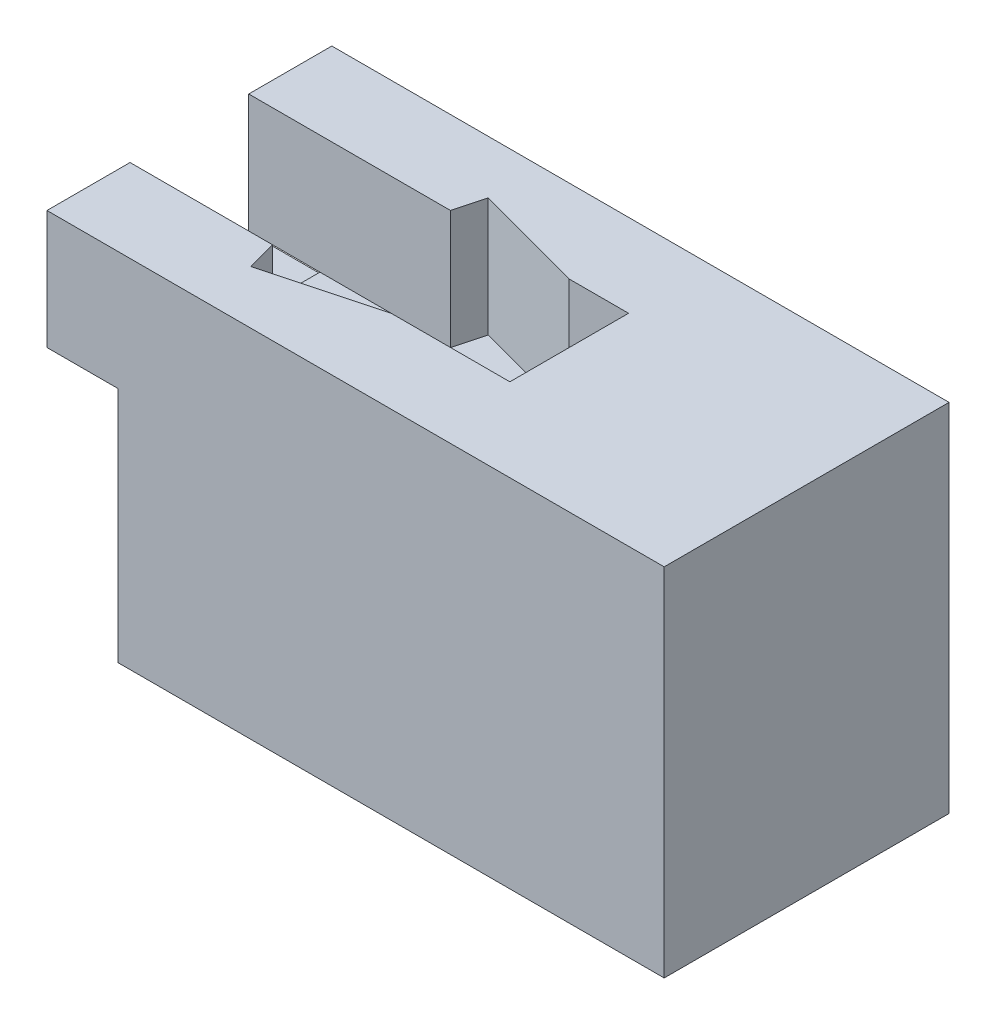
ISO-10303-21;
HEADER;
FILE_DESCRIPTION(('STEP AP214'),'2;1');
FILE_NAME('part.step','',(''),(''),'','','');
FILE_SCHEMA(('AUTOMOTIVE_DESIGN { 1 0 10303 214 1 1 1 1 }'));
ENDSEC;
DATA;
#1=APPLICATION_CONTEXT('core data for automotive mechanical design processes');
#2=APPLICATION_PROTOCOL_DEFINITION('international standard','automotive_design',2000,#1);
#3=PRODUCT_CONTEXT('',#1,'mechanical');
#4=PRODUCT('Part','Part','',(#3));
#5=PRODUCT_RELATED_PRODUCT_CATEGORY('part','',(#4));
#6=PRODUCT_DEFINITION_FORMATION('','',#4);
#7=PRODUCT_DEFINITION_CONTEXT('part definition',#1,'design');
#8=PRODUCT_DEFINITION('design','',#6,#7);
#9=PRODUCT_DEFINITION_SHAPE('','',#8);
#10=(LENGTH_UNIT() NAMED_UNIT(*) SI_UNIT(.MILLI.,.METRE.));
#11=(NAMED_UNIT(*) PLANE_ANGLE_UNIT() SI_UNIT($,.RADIAN.));
#12=(NAMED_UNIT(*) SI_UNIT($,.STERADIAN.) SOLID_ANGLE_UNIT());
#13=UNCERTAINTY_MEASURE_WITH_UNIT(LENGTH_MEASURE(1.E-05),#10,'distance_accuracy_value','');
#14=(GEOMETRIC_REPRESENTATION_CONTEXT(3) GLOBAL_UNCERTAINTY_ASSIGNED_CONTEXT((#13)) GLOBAL_UNIT_ASSIGNED_CONTEXT((#10,
#11,#12)) REPRESENTATION_CONTEXT('',''));
#15=CARTESIAN_POINT('',(0.,0.,0.));
#16=DIRECTION('',(0.,0.,1.));
#17=DIRECTION('',(1.,0.,0.));
#18=AXIS2_PLACEMENT_3D('',#15,#16,#17);
#19=CARTESIAN_POINT('',(-30.,0.,0.));
#20=DIRECTION('',(1.,0.,0.));
#21=DIRECTION('',(0.,0.,-1.));
#22=AXIS2_PLACEMENT_3D('',#19,#20,#21);
#23=PLANE('',#22);
#24=DIRECTION('',(0.,-1.,0.));
#25=VECTOR('',#24,1.);
#26=CARTESIAN_POINT('',(-30.,0.,-85.));
#27=LINE('',#26,#25);
#28=CARTESIAN_POINT('',(-30.,99.5,-85.));
#29=VERTEX_POINT('',#28);
#30=CARTESIAN_POINT('',(-30.,0.,-85.));
#31=VERTEX_POINT('',#30);
#32=EDGE_CURVE('E51',#29,#31,#27,.T.);
#33=ORIENTED_EDGE('',*,*,#32,.F.);
#34=DIRECTION('',(0.,0.,1.));
#35=VECTOR('',#34,1.);
#36=CARTESIAN_POINT('',(-30.,99.5,0.));
#37=LINE('',#36,#35);
#38=CARTESIAN_POINT('',(-30.,99.5,-35.));
#39=VERTEX_POINT('',#38);
#40=EDGE_CURVE('E56',#29,#39,#37,.T.);
#41=ORIENTED_EDGE('',*,*,#40,.T.);
#42=DIRECTION('',(0.,-1.,0.));
#43=VECTOR('',#42,1.);
#44=CARTESIAN_POINT('',(-30.,0.,-35.));
#45=LINE('',#44,#43);
#46=CARTESIAN_POINT('',(-30.,0.,-35.));
#47=VERTEX_POINT('',#46);
#48=EDGE_CURVE('E199',#39,#47,#45,.T.);
#49=ORIENTED_EDGE('',*,*,#48,.T.);
#50=DIRECTION('',(0.,0.,1.));
#51=VECTOR('',#50,1.);
#52=CARTESIAN_POINT('',(-30.,0.,-120.));
#53=LINE('',#52,#51);
#54=CARTESIAN_POINT('',(-30.,0.,0.));
#55=VERTEX_POINT('',#54);
#56=EDGE_CURVE('E256',#47,#55,#53,.T.);
#57=ORIENTED_EDGE('',*,*,#56,.T.);
#58=DIRECTION('',(0.,1.,0.));
#59=VECTOR('',#58,1.);
#60=CARTESIAN_POINT('',(-30.,0.,0.));
#61=LINE('',#60,#59);
#62=CARTESIAN_POINT('',(-30.,100.,0.));
#63=VERTEX_POINT('',#62);
#64=EDGE_CURVE('E259',#55,#63,#61,.T.);
#65=ORIENTED_EDGE('',*,*,#64,.T.);
#66=DIRECTION('',(0.,0.,1.));
#67=VECTOR('',#66,1.);
#68=CARTESIAN_POINT('',(-30.,100.,0.));
#69=LINE('',#68,#67);
#70=CARTESIAN_POINT('',(-30.,100.,-35.));
#71=VERTEX_POINT('',#70);
#72=EDGE_CURVE('E185',#71,#63,#69,.T.);
#73=ORIENTED_EDGE('',*,*,#72,.F.);
#74=DIRECTION('',(0.,0.,-1.));
#75=VECTOR('',#74,1.);
#76=CARTESIAN_POINT('',(-30.,100.,-35.));
#77=LINE('',#76,#75);
#78=CARTESIAN_POINT('',(-30.,100.,-85.));
#79=VERTEX_POINT('',#78);
#80=EDGE_CURVE('E252',#71,#79,#77,.T.);
#81=ORIENTED_EDGE('',*,*,#80,.T.);
#82=DIRECTION('',(0.,0.,1.));
#83=VECTOR('',#82,1.);
#84=CARTESIAN_POINT('',(-30.,100.,0.));
#85=LINE('',#84,#83);
#86=CARTESIAN_POINT('',(-30.,100.,-120.));
#87=VERTEX_POINT('',#86);
#88=EDGE_CURVE('E232',#87,#79,#85,.T.);
#89=ORIENTED_EDGE('',*,*,#88,.F.);
#90=DIRECTION('',(0.,-1.,0.));
#91=VECTOR('',#90,1.);
#92=CARTESIAN_POINT('',(-30.,150.,-120.));
#93=LINE('',#92,#91);
#94=CARTESIAN_POINT('',(-30.,0.,-120.));
#95=VERTEX_POINT('',#94);
#96=EDGE_CURVE('E254',#87,#95,#93,.T.);
#97=ORIENTED_EDGE('',*,*,#96,.T.);
#98=EDGE_CURVE('E257',#95,#31,#53,.T.);
#99=ORIENTED_EDGE('',*,*,#98,.T.);
#100=EDGE_LOOP('',(#33,#41,#49,#57,#65,#73,#81,#89,#97,#99));
#101=FACE_BOUND('',#100,.T.);
#102=ADVANCED_FACE('F36',(#101),#23,.F.);
#103=CARTESIAN_POINT('',(200.,150.,0.));
#104=DIRECTION('',(0.,-1.,0.));
#105=DIRECTION('',(0.,0.,-1.));
#106=AXIS2_PLACEMENT_3D('',#103,#104,#105);
#107=PLANE('',#106);
#108=DIRECTION('',(1.,0.,0.));
#109=VECTOR('',#108,1.);
#110=CARTESIAN_POINT('',(0.,150.,-85.));
#111=LINE('',#110,#109);
#112=CARTESIAN_POINT('',(-60.,150.,-85.));
#113=VERTEX_POINT('',#112);
#114=CARTESIAN_POINT('',(25.,150.,-85.));
#115=VERTEX_POINT('',#114);
#116=EDGE_CURVE('E270',#113,#115,#111,.T.);
#117=ORIENTED_EDGE('',*,*,#116,.T.);
#118=DIRECTION('',(-0.258819045102525,0.,0.965925826289067));
#119=VECTOR('',#118,1.);
#120=CARTESIAN_POINT('',(2.07531754730515,150.,0.556079660838562));
#121=LINE('',#120,#119);
#122=CARTESIAN_POINT('',(28.349364905389,150.,-97.4999999999997));
#123=VERTEX_POINT('',#122);
#124=EDGE_CURVE('E304',#123,#115,#121,.T.);
#125=ORIENTED_EDGE('',*,*,#124,.F.);
#126=DIRECTION('',(-0.96592582628907,0.,-0.258819045102514));
#127=VECTOR('',#126,1.);
#128=CARTESIAN_POINT('',(26.2740473580828,150.,-98.0560796608385));
#129=LINE('',#128,#127);
#130=CARTESIAN_POINT('',(75.,150.,-85.));
#131=VERTEX_POINT('',#130);
#132=EDGE_CURVE('E301',#131,#123,#129,.T.);
#133=ORIENTED_EDGE('',*,*,#132,.F.);
#134=CARTESIAN_POINT('',(100.,150.,-85.));
#135=VERTEX_POINT('',#134);
#136=EDGE_CURVE('E298',#131,#135,#111,.T.);
#137=ORIENTED_EDGE('',*,*,#136,.T.);
#138=DIRECTION('',(0.,0.,1.));
#139=VECTOR('',#138,1.);
#140=CARTESIAN_POINT('',(100.,150.,0.));
#141=LINE('',#140,#139);
#142=CARTESIAN_POINT('',(100.,150.,-35.));
#143=VERTEX_POINT('',#142);
#144=EDGE_CURVE('E295',#135,#143,#141,.T.);
#145=ORIENTED_EDGE('',*,*,#144,.T.);
#146=DIRECTION('',(1.,0.,0.));
#147=VECTOR('',#146,1.);
#148=CARTESIAN_POINT('',(0.,150.,-35.));
#149=LINE('',#148,#147);
#150=CARTESIAN_POINT('',(50.,150.,-35.));
#151=VERTEX_POINT('',#150);
#152=EDGE_CURVE('E292',#151,#143,#149,.T.);
#153=ORIENTED_EDGE('',*,*,#152,.F.);
#154=DIRECTION('',(0.96592582628907,0.,-0.258819045102514));
#155=VECTOR('',#154,1.);
#156=CARTESIAN_POINT('',(-5.40063509461093,150.,-20.1554445662281));
#157=LINE('',#156,#155);
#158=CARTESIAN_POINT('',(3.34936490538902,150.,-22.5000000000003));
#159=VERTEX_POINT('',#158);
#160=EDGE_CURVE('E289',#159,#151,#157,.T.);
#161=ORIENTED_EDGE('',*,*,#160,.F.);
#162=DIRECTION('',(0.258819045102525,0.,0.965925826289067));
#163=VECTOR('',#162,1.);
#164=CARTESIAN_POINT('',(8.75000000000014,150.,-2.3445554337724));
#165=LINE('',#164,#163);
#166=CARTESIAN_POINT('',(0.,150.,-35.));
#167=VERTEX_POINT('',#166);
#168=EDGE_CURVE('E265',#167,#159,#165,.T.);
#169=ORIENTED_EDGE('',*,*,#168,.F.);
#170=DIRECTION('',(1.,0.,0.));
#171=VECTOR('',#170,1.);
#172=CARTESIAN_POINT('',(-30.,150.,-35.));
#173=LINE('',#172,#171);
#174=CARTESIAN_POINT('',(-60.,150.,-35.));
#175=VERTEX_POINT('',#174);
#176=EDGE_CURVE('E261',#175,#167,#173,.T.);
#177=ORIENTED_EDGE('',*,*,#176,.F.);
#178=DIRECTION('',(0.,0.,-1.));
#179=VECTOR('',#178,1.);
#180=CARTESIAN_POINT('',(-60.,150.,0.));
#181=LINE('',#180,#179);
#182=CARTESIAN_POINT('',(-60.,150.,0.));
#183=VERTEX_POINT('',#182);
#184=EDGE_CURVE('E221',#183,#175,#181,.T.);
#185=ORIENTED_EDGE('',*,*,#184,.F.);
#186=DIRECTION('',(-1.,0.,0.));
#187=VECTOR('',#186,1.);
#188=CARTESIAN_POINT('',(200.,150.,0.));
#189=LINE('',#188,#187);
#190=CARTESIAN_POINT('',(200.,150.,0.));
#191=VERTEX_POINT('',#190);
#192=EDGE_CURVE('E333',#191,#183,#189,.T.);
#193=ORIENTED_EDGE('',*,*,#192,.F.);
#194=DIRECTION('',(0.,0.,1.));
#195=VECTOR('',#194,1.);
#196=CARTESIAN_POINT('',(200.,150.,0.));
#197=LINE('',#196,#195);
#198=CARTESIAN_POINT('',(200.,150.,-120.));
#199=VERTEX_POINT('',#198);
#200=EDGE_CURVE('E331',#199,#191,#197,.T.);
#201=ORIENTED_EDGE('',*,*,#200,.F.);
#202=DIRECTION('',(-1.,0.,0.));
#203=VECTOR('',#202,1.);
#204=CARTESIAN_POINT('',(200.,150.,-120.));
#205=LINE('',#204,#203);
#206=CARTESIAN_POINT('',(-60.,150.,-120.));
#207=VERTEX_POINT('',#206);
#208=EDGE_CURVE('E335',#199,#207,#205,.T.);
#209=ORIENTED_EDGE('',*,*,#208,.T.);
#210=DIRECTION('',(0.,0.,-1.));
#211=VECTOR('',#210,1.);
#212=CARTESIAN_POINT('',(-60.,150.,0.));
#213=LINE('',#212,#211);
#214=EDGE_CURVE('E241',#113,#207,#213,.T.);
#215=ORIENTED_EDGE('',*,*,#214,.F.);
#216=EDGE_LOOP('',(#117,#125,#133,#137,#145,#153,#161,#169,#177,#185,#193,#201,#209,#215));
#217=FACE_BOUND('',#216,.T.);
#218=ADVANCED_FACE('F363',(#217),#107,.F.);
#219=CARTESIAN_POINT('',(200.,0.,0.));
#220=DIRECTION('',(0.,0.,-1.));
#221=DIRECTION('',(-1.,0.,0.));
#222=AXIS2_PLACEMENT_3D('',#219,#220,#221);
#223=PLANE('',#222);
#224=ORIENTED_EDGE('',*,*,#192,.T.);
#225=DIRECTION('',(0.,1.,0.));
#226=VECTOR('',#225,1.);
#227=CARTESIAN_POINT('',(-60.,0.,0.));
#228=LINE('',#227,#226);
#229=CARTESIAN_POINT('',(-60.,100.,0.));
#230=VERTEX_POINT('',#229);
#231=EDGE_CURVE('E218',#230,#183,#228,.T.);
#232=ORIENTED_EDGE('',*,*,#231,.F.);
#233=DIRECTION('',(1.,0.,0.));
#234=VECTOR('',#233,1.);
#235=CARTESIAN_POINT('',(-60.,100.,0.));
#236=LINE('',#235,#234);
#237=EDGE_CURVE('E224',#230,#63,#236,.T.);
#238=ORIENTED_EDGE('',*,*,#237,.T.);
#239=ORIENTED_EDGE('',*,*,#64,.F.);
#240=DIRECTION('',(-1.,0.,0.));
#241=VECTOR('',#240,1.);
#242=CARTESIAN_POINT('',(200.,0.,0.));
#243=LINE('',#242,#241);
#244=CARTESIAN_POINT('',(200.,0.,0.));
#245=VERTEX_POINT('',#244);
#246=EDGE_CURVE('E11',#245,#55,#243,.T.);
#247=ORIENTED_EDGE('',*,*,#246,.F.);
#248=DIRECTION('',(0.,-1.,0.));
#249=VECTOR('',#248,1.);
#250=CARTESIAN_POINT('',(200.,0.,0.));
#251=LINE('',#250,#249);
#252=EDGE_CURVE('E309',#191,#245,#251,.T.);
#253=ORIENTED_EDGE('',*,*,#252,.F.);
#254=EDGE_LOOP('',(#224,#232,#238,#239,#247,#253));
#255=FACE_BOUND('',#254,.T.);
#256=ADVANCED_FACE('F38',(#255),#223,.F.);
#257=CARTESIAN_POINT('',(200.,0.,0.));
#258=DIRECTION('',(0.,1.,0.));
#259=DIRECTION('',(0.,0.,1.));
#260=AXIS2_PLACEMENT_3D('',#257,#258,#259);
#261=PLANE('',#260);
#262=ORIENTED_EDGE('',*,*,#246,.T.);
#263=ORIENTED_EDGE('',*,*,#56,.F.);
#264=DIRECTION('',(1.,0.,0.));
#265=VECTOR('',#264,1.);
#266=CARTESIAN_POINT('',(-60.,0.,-35.));
#267=LINE('',#266,#265);
#268=CARTESIAN_POINT('',(-60.,0.,-35.));
#269=VERTEX_POINT('',#268);
#270=EDGE_CURVE('E209',#269,#47,#267,.T.);
#271=ORIENTED_EDGE('',*,*,#270,.F.);
#272=DIRECTION('',(0.,0.,1.));
#273=VECTOR('',#272,1.);
#274=CARTESIAN_POINT('',(-60.,0.,0.));
#275=LINE('',#274,#273);
#276=CARTESIAN_POINT('',(-60.,0.,-85.));
#277=VERTEX_POINT('',#276);
#278=EDGE_CURVE('E194',#277,#269,#275,.T.);
#279=ORIENTED_EDGE('',*,*,#278,.F.);
#280=DIRECTION('',(1.,0.,0.));
#281=VECTOR('',#280,1.);
#282=CARTESIAN_POINT('',(-60.,0.,-85.));
#283=LINE('',#282,#281);
#284=EDGE_CURVE('E186',#277,#31,#283,.T.);
#285=ORIENTED_EDGE('',*,*,#284,.T.);
#286=ORIENTED_EDGE('',*,*,#98,.F.);
#287=DIRECTION('',(-1.,0.,0.));
#288=VECTOR('',#287,1.);
#289=CARTESIAN_POINT('',(200.,0.,-120.));
#290=LINE('',#289,#288);
#291=CARTESIAN_POINT('',(200.,0.,-120.));
#292=VERTEX_POINT('',#291);
#293=EDGE_CURVE('E44',#292,#95,#290,.T.);
#294=ORIENTED_EDGE('',*,*,#293,.F.);
#295=DIRECTION('',(0.,0.,-1.));
#296=VECTOR('',#295,1.);
#297=CARTESIAN_POINT('',(200.,0.,0.));
#298=LINE('',#297,#296);
#299=EDGE_CURVE('E327',#245,#292,#298,.T.);
#300=ORIENTED_EDGE('',*,*,#299,.F.);
#301=EDGE_LOOP('',(#262,#263,#271,#279,#285,#286,#294,#300));
#302=FACE_BOUND('',#301,.T.);
#303=ADVANCED_FACE('F346',(#302),#261,.F.);
#304=CARTESIAN_POINT('',(200.,0.,-120.));
#305=DIRECTION('',(0.,0.,1.));
#306=DIRECTION('',(1.,0.,0.));
#307=AXIS2_PLACEMENT_3D('',#304,#305,#306);
#308=PLANE('',#307);
#309=ORIENTED_EDGE('',*,*,#293,.T.);
#310=ORIENTED_EDGE('',*,*,#96,.F.);
#311=DIRECTION('',(1.,0.,0.));
#312=VECTOR('',#311,1.);
#313=CARTESIAN_POINT('',(-60.,100.,-120.));
#314=LINE('',#313,#312);
#315=CARTESIAN_POINT('',(-60.,100.,-120.));
#316=VERTEX_POINT('',#315);
#317=EDGE_CURVE('E249',#316,#87,#314,.T.);
#318=ORIENTED_EDGE('',*,*,#317,.F.);
#319=DIRECTION('',(0.,-1.,0.));
#320=VECTOR('',#319,1.);
#321=CARTESIAN_POINT('',(-60.,0.,-120.));
#322=LINE('',#321,#320);
#323=EDGE_CURVE('E233',#207,#316,#322,.T.);
#324=ORIENTED_EDGE('',*,*,#323,.F.);
#325=ORIENTED_EDGE('',*,*,#208,.F.);
#326=DIRECTION('',(0.,1.,0.));
#327=VECTOR('',#326,1.);
#328=CARTESIAN_POINT('',(200.,0.,-120.));
#329=LINE('',#328,#327);
#330=EDGE_CURVE('E329',#292,#199,#329,.T.);
#331=ORIENTED_EDGE('',*,*,#330,.F.);
#332=EDGE_LOOP('',(#309,#310,#318,#324,#325,#331));
#333=FACE_BOUND('',#332,.T.);
#334=ADVANCED_FACE('F342',(#333),#308,.F.);
#335=CARTESIAN_POINT('',(200.,0.,0.));
#336=DIRECTION('',(-1.,0.,0.));
#337=DIRECTION('',(0.,0.,1.));
#338=AXIS2_PLACEMENT_3D('',#335,#336,#337);
#339=PLANE('',#338);
#340=ORIENTED_EDGE('',*,*,#252,.T.);
#341=ORIENTED_EDGE('',*,*,#299,.T.);
#342=ORIENTED_EDGE('',*,*,#330,.T.);
#343=ORIENTED_EDGE('',*,*,#200,.T.);
#344=EDGE_LOOP('',(#340,#341,#342,#343));
#345=FACE_BOUND('',#344,.T.);
#346=ADVANCED_FACE('F370',(#345),#339,.F.);
#347=CARTESIAN_POINT('',(0.,100.,-85.));
#348=DIRECTION('',(0.,0.,1.));
#349=DIRECTION('',(1.,0.,0.));
#350=AXIS2_PLACEMENT_3D('',#347,#348,#349);
#351=PLANE('',#350);
#352=ORIENTED_EDGE('',*,*,#116,.F.);
#353=DIRECTION('',(0.,1.,0.));
#354=VECTOR('',#353,1.);
#355=CARTESIAN_POINT('',(-60.,0.,-85.));
#356=LINE('',#355,#354);
#357=CARTESIAN_POINT('',(-60.,100.,-85.));
#358=VERTEX_POINT('',#357);
#359=EDGE_CURVE('E238',#358,#113,#356,.T.);
#360=ORIENTED_EDGE('',*,*,#359,.F.);
#361=DIRECTION('',(1.,0.,0.));
#362=VECTOR('',#361,1.);
#363=CARTESIAN_POINT('',(-60.,100.,-85.));
#364=LINE('',#363,#362);
#365=EDGE_CURVE('E244',#358,#79,#364,.T.);
#366=ORIENTED_EDGE('',*,*,#365,.T.);
#367=DIRECTION('',(1.,0.,0.));
#368=VECTOR('',#367,1.);
#369=CARTESIAN_POINT('',(0.,100.,-85.));
#370=LINE('',#369,#368);
#371=CARTESIAN_POINT('',(25.,100.,-85.));
#372=VERTEX_POINT('',#371);
#373=EDGE_CURVE('E281',#79,#372,#370,.T.);
#374=ORIENTED_EDGE('',*,*,#373,.T.);
#375=DIRECTION('',(0.,1.,0.));
#376=VECTOR('',#375,1.);
#377=CARTESIAN_POINT('',(25.,100.,-85.));
#378=LINE('',#377,#376);
#379=EDGE_CURVE('E307',#372,#115,#378,.T.);
#380=ORIENTED_EDGE('',*,*,#379,.T.);
#381=EDGE_LOOP('',(#352,#360,#366,#374,#380));
#382=FACE_BOUND('',#381,.T.);
#383=ADVANCED_FACE('F355',(#382),#351,.T.);
#384=CARTESIAN_POINT('',(2.07531754730515,100.,0.556079660838562));
#385=DIRECTION('',(-0.965925826289067,0.,-0.258819045102525));
#386=DIRECTION('',(-0.258819045102525,0.,0.965925826289067));
#387=AXIS2_PLACEMENT_3D('',#384,#385,#386);
#388=PLANE('',#387);
#389=ORIENTED_EDGE('',*,*,#124,.T.);
#390=ORIENTED_EDGE('',*,*,#379,.F.);
#391=DIRECTION('',(-0.258819045102525,0.,0.965925826289067));
#392=VECTOR('',#391,1.);
#393=CARTESIAN_POINT('',(2.07531754730515,100.,0.556079660838562));
#394=LINE('',#393,#392);
#395=CARTESIAN_POINT('',(28.349364905389,100.,-97.4999999999997));
#396=VERTEX_POINT('',#395);
#397=EDGE_CURVE('E284',#396,#372,#394,.T.);
#398=ORIENTED_EDGE('',*,*,#397,.F.);
#399=DIRECTION('',(0.,1.,0.));
#400=VECTOR('',#399,1.);
#401=CARTESIAN_POINT('',(28.349364905389,100.,-97.4999999999997));
#402=LINE('',#401,#400);
#403=EDGE_CURVE('E310',#396,#123,#402,.T.);
#404=ORIENTED_EDGE('',*,*,#403,.T.);
#405=EDGE_LOOP('',(#389,#390,#398,#404));
#406=FACE_BOUND('',#405,.T.);
#407=ADVANCED_FACE('F391',(#406),#388,.F.);
#408=CARTESIAN_POINT('',(26.2740473580828,100.,-98.0560796608385));
#409=DIRECTION('',(0.258819045102514,0.,-0.96592582628907));
#410=DIRECTION('',(-0.96592582628907,0.,-0.258819045102514));
#411=AXIS2_PLACEMENT_3D('',#408,#409,#410);
#412=PLANE('',#411);
#413=ORIENTED_EDGE('',*,*,#132,.T.);
#414=ORIENTED_EDGE('',*,*,#403,.F.);
#415=DIRECTION('',(-0.96592582628907,0.,-0.258819045102514));
#416=VECTOR('',#415,1.);
#417=CARTESIAN_POINT('',(26.2740473580828,100.,-98.0560796608385));
#418=LINE('',#417,#416);
#419=CARTESIAN_POINT('',(75.,100.,-85.));
#420=VERTEX_POINT('',#419);
#421=EDGE_CURVE('E280',#420,#396,#418,.T.);
#422=ORIENTED_EDGE('',*,*,#421,.F.);
#423=DIRECTION('',(0.,1.,0.));
#424=VECTOR('',#423,1.);
#425=CARTESIAN_POINT('',(75.,100.,-85.));
#426=LINE('',#425,#424);
#427=EDGE_CURVE('E312',#420,#131,#426,.T.);
#428=ORIENTED_EDGE('',*,*,#427,.T.);
#429=EDGE_LOOP('',(#413,#414,#422,#428));
#430=FACE_BOUND('',#429,.T.);
#431=ADVANCED_FACE('F395',(#430),#412,.F.);
#432=ORIENTED_EDGE('',*,*,#136,.F.);
#433=ORIENTED_EDGE('',*,*,#427,.F.);
#434=CARTESIAN_POINT('',(100.,100.,-85.));
#435=VERTEX_POINT('',#434);
#436=EDGE_CURVE('E278',#420,#435,#370,.T.);
#437=ORIENTED_EDGE('',*,*,#436,.T.);
#438=DIRECTION('',(0.,1.,0.));
#439=VECTOR('',#438,1.);
#440=CARTESIAN_POINT('',(100.,100.,-85.));
#441=LINE('',#440,#439);
#442=EDGE_CURVE('E314',#435,#135,#441,.T.);
#443=ORIENTED_EDGE('',*,*,#442,.T.);
#444=EDGE_LOOP('',(#432,#433,#437,#443));
#445=FACE_BOUND('',#444,.T.);
#446=ADVANCED_FACE('F397',(#445),#351,.T.);
#447=CARTESIAN_POINT('',(100.,100.,0.));
#448=DIRECTION('',(-1.,0.,0.));
#449=DIRECTION('',(0.,0.,1.));
#450=AXIS2_PLACEMENT_3D('',#447,#448,#449);
#451=PLANE('',#450);
#452=ORIENTED_EDGE('',*,*,#144,.F.);
#453=ORIENTED_EDGE('',*,*,#442,.F.);
#454=DIRECTION('',(0.,0.,1.));
#455=VECTOR('',#454,1.);
#456=CARTESIAN_POINT('',(100.,100.,0.));
#457=LINE('',#456,#455);
#458=CARTESIAN_POINT('',(100.,100.,-35.));
#459=VERTEX_POINT('',#458);
#460=EDGE_CURVE('E276',#435,#459,#457,.T.);
#461=ORIENTED_EDGE('',*,*,#460,.T.);
#462=DIRECTION('',(0.,1.,0.));
#463=VECTOR('',#462,1.);
#464=CARTESIAN_POINT('',(100.,100.,-35.));
#465=LINE('',#464,#463);
#466=EDGE_CURVE('E316',#459,#143,#465,.T.);
#467=ORIENTED_EDGE('',*,*,#466,.T.);
#468=EDGE_LOOP('',(#452,#453,#461,#467));
#469=FACE_BOUND('',#468,.T.);
#470=ADVANCED_FACE('F402',(#469),#451,.T.);
#471=CARTESIAN_POINT('',(0.,100.,-35.));
#472=DIRECTION('',(0.,0.,1.));
#473=DIRECTION('',(1.,0.,0.));
#474=AXIS2_PLACEMENT_3D('',#471,#472,#473);
#475=PLANE('',#474);
#476=ORIENTED_EDGE('',*,*,#152,.T.);
#477=ORIENTED_EDGE('',*,*,#466,.F.);
#478=DIRECTION('',(1.,0.,0.));
#479=VECTOR('',#478,1.);
#480=CARTESIAN_POINT('',(0.,100.,-35.));
#481=LINE('',#480,#479);
#482=CARTESIAN_POINT('',(50.,100.,-35.));
#483=VERTEX_POINT('',#482);
#484=EDGE_CURVE('E273',#483,#459,#481,.T.);
#485=ORIENTED_EDGE('',*,*,#484,.F.);
#486=DIRECTION('',(0.,1.,0.));
#487=VECTOR('',#486,1.);
#488=CARTESIAN_POINT('',(50.,100.,-35.));
#489=LINE('',#488,#487);
#490=EDGE_CURVE('E318',#483,#151,#489,.T.);
#491=ORIENTED_EDGE('',*,*,#490,.T.);
#492=EDGE_LOOP('',(#476,#477,#485,#491));
#493=FACE_BOUND('',#492,.T.);
#494=ADVANCED_FACE('F408',(#493),#475,.F.);
#495=CARTESIAN_POINT('',(-5.40063509461093,100.,-20.1554445662281));
#496=DIRECTION('',(0.258819045102515,0.,0.96592582628907));
#497=DIRECTION('',(0.96592582628907,0.,-0.258819045102515));
#498=AXIS2_PLACEMENT_3D('',#495,#496,#497);
#499=PLANE('',#498);
#500=ORIENTED_EDGE('',*,*,#160,.T.);
#501=ORIENTED_EDGE('',*,*,#490,.F.);
#502=DIRECTION('',(0.96592582628907,0.,-0.258819045102514));
#503=VECTOR('',#502,1.);
#504=CARTESIAN_POINT('',(-5.40063509461093,100.,-20.1554445662281));
#505=LINE('',#504,#503);
#506=CARTESIAN_POINT('',(3.34936490538902,100.,-22.5000000000003));
#507=VERTEX_POINT('',#506);
#508=EDGE_CURVE('E269',#507,#483,#505,.T.);
#509=ORIENTED_EDGE('',*,*,#508,.F.);
#510=DIRECTION('',(0.,1.,0.));
#511=VECTOR('',#510,1.);
#512=CARTESIAN_POINT('',(3.34936490538902,100.,-22.5000000000003));
#513=LINE('',#512,#511);
#514=EDGE_CURVE('E320',#507,#159,#513,.T.);
#515=ORIENTED_EDGE('',*,*,#514,.T.);
#516=EDGE_LOOP('',(#500,#501,#509,#515));
#517=FACE_BOUND('',#516,.T.);
#518=ADVANCED_FACE('F412',(#517),#499,.F.);
#519=CARTESIAN_POINT('',(8.75000000000014,100.,-2.3445554337724));
#520=DIRECTION('',(-0.965925826289067,0.,0.258819045102525));
#521=DIRECTION('',(0.258819045102525,0.,0.965925826289067));
#522=AXIS2_PLACEMENT_3D('',#519,#520,#521);
#523=PLANE('',#522);
#524=ORIENTED_EDGE('',*,*,#168,.T.);
#525=ORIENTED_EDGE('',*,*,#514,.F.);
#526=DIRECTION('',(0.258819045102525,0.,0.965925826289067));
#527=VECTOR('',#526,1.);
#528=CARTESIAN_POINT('',(8.75000000000014,100.,-2.3445554337724));
#529=LINE('',#528,#527);
#530=CARTESIAN_POINT('',(0.,100.,-35.));
#531=VERTEX_POINT('',#530);
#532=EDGE_CURVE('E266',#531,#507,#529,.T.);
#533=ORIENTED_EDGE('',*,*,#532,.F.);
#534=DIRECTION('',(0.,1.,0.));
#535=VECTOR('',#534,1.);
#536=CARTESIAN_POINT('',(0.,100.,-35.));
#537=LINE('',#536,#535);
#538=EDGE_CURVE('E322',#531,#167,#537,.T.);
#539=ORIENTED_EDGE('',*,*,#538,.T.);
#540=EDGE_LOOP('',(#524,#525,#533,#539));
#541=FACE_BOUND('',#540,.T.);
#542=ADVANCED_FACE('F414',(#541),#523,.F.);
#543=CARTESIAN_POINT('',(0.,100.,0.));
#544=DIRECTION('',(0.,1.,0.));
#545=DIRECTION('',(0.,0.,1.));
#546=AXIS2_PLACEMENT_3D('',#543,#544,#545);
#547=PLANE('',#546);
#548=ORIENTED_EDGE('',*,*,#373,.F.);
#549=ORIENTED_EDGE('',*,*,#80,.F.);
#550=DIRECTION('',(1.,0.,0.));
#551=VECTOR('',#550,1.);
#552=CARTESIAN_POINT('',(-30.,100.,-35.));
#553=LINE('',#552,#551);
#554=EDGE_CURVE('E263',#71,#531,#553,.T.);
#555=ORIENTED_EDGE('',*,*,#554,.T.);
#556=ORIENTED_EDGE('',*,*,#532,.T.);
#557=ORIENTED_EDGE('',*,*,#508,.T.);
#558=ORIENTED_EDGE('',*,*,#484,.T.);
#559=ORIENTED_EDGE('',*,*,#460,.F.);
#560=ORIENTED_EDGE('',*,*,#436,.F.);
#561=ORIENTED_EDGE('',*,*,#421,.T.);
#562=ORIENTED_EDGE('',*,*,#397,.T.);
#563=EDGE_LOOP('',(#548,#549,#555,#556,#557,#558,#559,#560,#561,#562));
#564=FACE_BOUND('',#563,.T.);
#565=ADVANCED_FACE('F386',(#564),#547,.T.);
#566=CARTESIAN_POINT('',(-30.,150.,-35.));
#567=DIRECTION('',(0.,0.,1.));
#568=DIRECTION('',(1.,0.,0.));
#569=AXIS2_PLACEMENT_3D('',#566,#567,#568);
#570=PLANE('',#569);
#571=ORIENTED_EDGE('',*,*,#538,.F.);
#572=ORIENTED_EDGE('',*,*,#554,.F.);
#573=DIRECTION('',(1.,0.,0.));
#574=VECTOR('',#573,1.);
#575=CARTESIAN_POINT('',(-60.,100.,-35.));
#576=LINE('',#575,#574);
#577=CARTESIAN_POINT('',(-60.,100.,-35.));
#578=VERTEX_POINT('',#577);
#579=EDGE_CURVE('E229',#578,#71,#576,.T.);
#580=ORIENTED_EDGE('',*,*,#579,.F.);
#581=DIRECTION('',(0.,-1.,0.));
#582=VECTOR('',#581,1.);
#583=CARTESIAN_POINT('',(-60.,0.,-35.));
#584=LINE('',#583,#582);
#585=EDGE_CURVE('E213',#175,#578,#584,.T.);
#586=ORIENTED_EDGE('',*,*,#585,.F.);
#587=ORIENTED_EDGE('',*,*,#176,.T.);
#588=EDGE_LOOP('',(#571,#572,#580,#586,#587));
#589=FACE_BOUND('',#588,.T.);
#590=ADVANCED_FACE('F383',(#589),#570,.F.);
#591=CARTESIAN_POINT('',(-60.,100.,0.));
#592=DIRECTION('',(0.,1.,0.));
#593=DIRECTION('',(0.,0.,1.));
#594=AXIS2_PLACEMENT_3D('',#591,#592,#593);
#595=PLANE('',#594);
#596=ORIENTED_EDGE('',*,*,#88,.T.);
#597=ORIENTED_EDGE('',*,*,#365,.F.);
#598=DIRECTION('',(0.,0.,1.));
#599=VECTOR('',#598,1.);
#600=CARTESIAN_POINT('',(-60.,100.,0.));
#601=LINE('',#600,#599);
#602=EDGE_CURVE('E236',#316,#358,#601,.T.);
#603=ORIENTED_EDGE('',*,*,#602,.F.);
#604=ORIENTED_EDGE('',*,*,#317,.T.);
#605=EDGE_LOOP('',(#596,#597,#603,#604));
#606=FACE_BOUND('',#605,.T.);
#607=ADVANCED_FACE('F352',(#606),#595,.F.);
#608=CARTESIAN_POINT('',(-60.,0.,0.));
#609=DIRECTION('',(-1.,0.,0.));
#610=DIRECTION('',(0.,0.,1.));
#611=AXIS2_PLACEMENT_3D('',#608,#609,#610);
#612=PLANE('',#611);
#613=ORIENTED_EDGE('',*,*,#323,.T.);
#614=ORIENTED_EDGE('',*,*,#602,.T.);
#615=ORIENTED_EDGE('',*,*,#359,.T.);
#616=ORIENTED_EDGE('',*,*,#214,.T.);
#617=EDGE_LOOP('',(#613,#614,#615,#616));
#618=FACE_BOUND('',#617,.T.);
#619=ADVANCED_FACE('F360',(#618),#612,.T.);
#620=CARTESIAN_POINT('',(-60.,100.,0.));
#621=DIRECTION('',(0.,1.,0.));
#622=DIRECTION('',(0.,0.,1.));
#623=AXIS2_PLACEMENT_3D('',#620,#621,#622);
#624=PLANE('',#623);
#625=ORIENTED_EDGE('',*,*,#72,.T.);
#626=ORIENTED_EDGE('',*,*,#237,.F.);
#627=DIRECTION('',(0.,0.,1.));
#628=VECTOR('',#627,1.);
#629=CARTESIAN_POINT('',(-60.,100.,0.));
#630=LINE('',#629,#628);
#631=EDGE_CURVE('E216',#578,#230,#630,.T.);
#632=ORIENTED_EDGE('',*,*,#631,.F.);
#633=ORIENTED_EDGE('',*,*,#579,.T.);
#634=EDGE_LOOP('',(#625,#626,#632,#633));
#635=FACE_BOUND('',#634,.T.);
#636=ADVANCED_FACE('F378',(#635),#624,.F.);
#637=CARTESIAN_POINT('',(-60.,0.,0.));
#638=DIRECTION('',(-1.,0.,0.));
#639=DIRECTION('',(0.,0.,1.));
#640=AXIS2_PLACEMENT_3D('',#637,#638,#639);
#641=PLANE('',#640);
#642=ORIENTED_EDGE('',*,*,#585,.T.);
#643=ORIENTED_EDGE('',*,*,#631,.T.);
#644=ORIENTED_EDGE('',*,*,#231,.T.);
#645=ORIENTED_EDGE('',*,*,#184,.T.);
#646=EDGE_LOOP('',(#642,#643,#644,#645));
#647=FACE_BOUND('',#646,.T.);
#648=ADVANCED_FACE('F416',(#647),#641,.T.);
#649=CARTESIAN_POINT('',(-60.,99.5,0.));
#650=DIRECTION('',(0.,1.,0.));
#651=DIRECTION('',(0.,0.,1.));
#652=AXIS2_PLACEMENT_3D('',#649,#650,#651);
#653=PLANE('',#652);
#654=ORIENTED_EDGE('',*,*,#40,.F.);
#655=DIRECTION('',(1.,0.,0.));
#656=VECTOR('',#655,1.);
#657=CARTESIAN_POINT('',(-60.,99.5,-85.));
#658=LINE('',#657,#656);
#659=CARTESIAN_POINT('',(-60.,99.5,-85.));
#660=VERTEX_POINT('',#659);
#661=EDGE_CURVE('E178',#660,#29,#658,.T.);
#662=ORIENTED_EDGE('',*,*,#661,.F.);
#663=DIRECTION('',(0.,0.,1.));
#664=VECTOR('',#663,1.);
#665=CARTESIAN_POINT('',(-60.,99.5,0.));
#666=LINE('',#665,#664);
#667=CARTESIAN_POINT('',(-60.,99.5,-35.));
#668=VERTEX_POINT('',#667);
#669=EDGE_CURVE('E182',#660,#668,#666,.T.);
#670=ORIENTED_EDGE('',*,*,#669,.T.);
#671=DIRECTION('',(1.,0.,0.));
#672=VECTOR('',#671,1.);
#673=CARTESIAN_POINT('',(-60.,99.5,-35.));
#674=LINE('',#673,#672);
#675=EDGE_CURVE('E205',#668,#39,#674,.T.);
#676=ORIENTED_EDGE('',*,*,#675,.T.);
#677=EDGE_LOOP('',(#654,#662,#670,#676));
#678=FACE_BOUND('',#677,.T.);
#679=ADVANCED_FACE('F180',(#678),#653,.T.);
#680=CARTESIAN_POINT('',(-60.,0.,-85.));
#681=DIRECTION('',(0.,0.,1.));
#682=DIRECTION('',(1.,0.,0.));
#683=AXIS2_PLACEMENT_3D('',#680,#681,#682);
#684=PLANE('',#683);
#685=ORIENTED_EDGE('',*,*,#32,.T.);
#686=ORIENTED_EDGE('',*,*,#284,.F.);
#687=DIRECTION('',(0.,-1.,0.));
#688=VECTOR('',#687,1.);
#689=CARTESIAN_POINT('',(-60.,0.,-85.));
#690=LINE('',#689,#688);
#691=EDGE_CURVE('E189',#660,#277,#690,.T.);
#692=ORIENTED_EDGE('',*,*,#691,.F.);
#693=ORIENTED_EDGE('',*,*,#661,.T.);
#694=EDGE_LOOP('',(#685,#686,#692,#693));
#695=FACE_BOUND('',#694,.T.);
#696=ADVANCED_FACE('F190',(#695),#684,.F.);
#697=CARTESIAN_POINT('',(-60.,0.,-35.));
#698=DIRECTION('',(0.,0.,1.));
#699=DIRECTION('',(0.,-1.,0.));
#700=AXIS2_PLACEMENT_3D('',#697,#698,#699);
#701=PLANE('',#700);
#702=ORIENTED_EDGE('',*,*,#48,.F.);
#703=ORIENTED_EDGE('',*,*,#675,.F.);
#704=DIRECTION('',(0.,-1.,0.));
#705=VECTOR('',#704,1.);
#706=CARTESIAN_POINT('',(-60.,0.,-35.));
#707=LINE('',#706,#705);
#708=EDGE_CURVE('E198',#668,#269,#707,.T.);
#709=ORIENTED_EDGE('',*,*,#708,.T.);
#710=ORIENTED_EDGE('',*,*,#270,.T.);
#711=EDGE_LOOP('',(#702,#703,#709,#710));
#712=FACE_BOUND('',#711,.T.);
#713=ADVANCED_FACE('F595',(#712),#701,.T.);
#714=CARTESIAN_POINT('',(-60.,0.,0.));
#715=DIRECTION('',(-1.,0.,0.));
#716=DIRECTION('',(0.,0.,1.));
#717=AXIS2_PLACEMENT_3D('',#714,#715,#716);
#718=PLANE('',#717);
#719=ORIENTED_EDGE('',*,*,#669,.F.);
#720=ORIENTED_EDGE('',*,*,#691,.T.);
#721=ORIENTED_EDGE('',*,*,#278,.T.);
#722=ORIENTED_EDGE('',*,*,#708,.F.);
#723=EDGE_LOOP('',(#719,#720,#721,#722));
#724=FACE_BOUND('',#723,.T.);
#725=ADVANCED_FACE('F196',(#724),#718,.T.);
#726=CLOSED_SHELL('',(#102,#218,#256,#303,#334,#346,#383,#407,#431,#446,#470,#494,#518,#542,
#565,#590,#607,#619,#636,#648,#679,#696,#713,#725));
#727=MANIFOLD_SOLID_BREP('B2',#726);
#728=ADVANCED_BREP_SHAPE_REPRESENTATION('',(#18,#727),#14);
#729=SHAPE_DEFINITION_REPRESENTATION(#9,#728);
ENDSEC;
END-ISO-10303-21;
